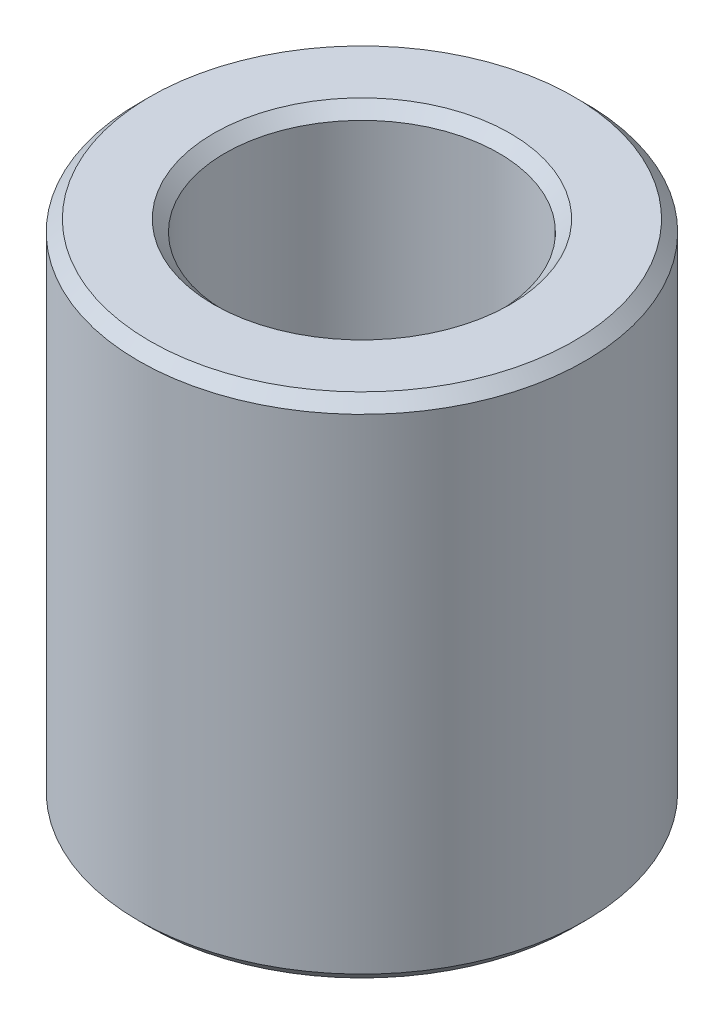
ISO-10303-21;
HEADER;
FILE_DESCRIPTION(('STEP AP214'),'2;1');
FILE_NAME('part.step','',(''),(''),'','','');
FILE_SCHEMA(('AUTOMOTIVE_DESIGN { 1 0 10303 214 1 1 1 1 }'));
ENDSEC;
DATA;
#1=APPLICATION_CONTEXT('core data for automotive mechanical design processes');
#2=APPLICATION_PROTOCOL_DEFINITION('international standard','automotive_design',2000,#1);
#3=PRODUCT_CONTEXT('',#1,'mechanical');
#4=PRODUCT('Part','Part','',(#3));
#5=PRODUCT_RELATED_PRODUCT_CATEGORY('part','',(#4));
#6=PRODUCT_DEFINITION_FORMATION('','',#4);
#7=PRODUCT_DEFINITION_CONTEXT('part definition',#1,'design');
#8=PRODUCT_DEFINITION('design','',#6,#7);
#9=PRODUCT_DEFINITION_SHAPE('','',#8);
#10=(LENGTH_UNIT() NAMED_UNIT(*) SI_UNIT(.MILLI.,.METRE.));
#11=(NAMED_UNIT(*) PLANE_ANGLE_UNIT() SI_UNIT($,.RADIAN.));
#12=(NAMED_UNIT(*) SI_UNIT($,.STERADIAN.) SOLID_ANGLE_UNIT());
#13=UNCERTAINTY_MEASURE_WITH_UNIT(LENGTH_MEASURE(1.E-05),#10,'distance_accuracy_value','');
#14=(GEOMETRIC_REPRESENTATION_CONTEXT(3) GLOBAL_UNCERTAINTY_ASSIGNED_CONTEXT((#13)) GLOBAL_UNIT_ASSIGNED_CONTEXT((#10,
#11,#12)) REPRESENTATION_CONTEXT('',''));
#15=CARTESIAN_POINT('',(0.,0.,0.));
#16=DIRECTION('',(0.,0.,1.));
#17=DIRECTION('',(1.,0.,0.));
#18=AXIS2_PLACEMENT_3D('',#15,#16,#17);
#19=CARTESIAN_POINT('',(0.,45.4693690637865,0.));
#20=DIRECTION('',(0.,-1.,0.));
#21=DIRECTION('',(0.,0.,-1.));
#22=AXIS2_PLACEMENT_3D('',#19,#20,#21);
#23=CYLINDRICAL_SURFACE('',#22,20.);
#24=CARTESIAN_POINT('',(0.,1.02240950876795,0.));
#25=DIRECTION('',(0.,1.,0.));
#26=DIRECTION('',(0.,0.,1.));
#27=AXIS2_PLACEMENT_3D('',#24,#25,#26);
#28=CIRCLE('',#27,20.);
#29=CARTESIAN_POINT('',(0.,1.02240950876795,20.));
#30=VERTEX_POINT('',#29);
#31=EDGE_CURVE('E10',#30,#30,#28,.T.);
#32=ORIENTED_EDGE('',*,*,#31,.T.);
#33=EDGE_LOOP('',(#32));
#34=FACE_BOUND('',#33,.T.);
#35=CARTESIAN_POINT('',(0.,44.4469595550186,0.));
#36=DIRECTION('',(0.,1.,0.));
#37=DIRECTION('',(0.,0.,1.));
#38=AXIS2_PLACEMENT_3D('',#35,#36,#37);
#39=CIRCLE('',#38,20.);
#40=CARTESIAN_POINT('',(0.,44.4469595550186,20.));
#41=VERTEX_POINT('',#40);
#42=EDGE_CURVE('E50',#41,#41,#39,.F.);
#43=ORIENTED_EDGE('',*,*,#42,.T.);
#44=EDGE_LOOP('',(#43));
#45=FACE_BOUND('',#44,.T.);
#46=ADVANCED_FACE('F39',(#34,#45),#23,.T.);
#47=CARTESIAN_POINT('',(0.,45.4693690637865,0.));
#48=DIRECTION('',(0.,1.,0.));
#49=DIRECTION('',(0.,0.,1.));
#50=AXIS2_PLACEMENT_3D('',#47,#48,#49);
#51=PLANE('',#50);
#52=CARTESIAN_POINT('',(0.,45.4693690637865,0.));
#53=DIRECTION('',(0.,1.,0.));
#54=DIRECTION('',(0.,0.,1.));
#55=AXIS2_PLACEMENT_3D('',#52,#53,#54);
#56=CIRCLE('',#55,13.2822934045507);
#57=CARTESIAN_POINT('',(0.,45.4693690637865,13.2822934045507));
#58=VERTEX_POINT('',#57);
#59=EDGE_CURVE('E58',#58,#58,#56,.F.);
#60=ORIENTED_EDGE('',*,*,#59,.T.);
#61=EDGE_LOOP('',(#60));
#62=FACE_BOUND('',#61,.T.);
#63=CARTESIAN_POINT('',(0.,45.4693690637865,0.));
#64=DIRECTION('',(0.,1.,0.));
#65=DIRECTION('',(0.,0.,1.));
#66=AXIS2_PLACEMENT_3D('',#63,#64,#65);
#67=CIRCLE('',#66,18.977590491232);
#68=CARTESIAN_POINT('',(0.,45.4693690637865,18.977590491232));
#69=VERTEX_POINT('',#68);
#70=EDGE_CURVE('E61',#69,#69,#67,.T.);
#71=ORIENTED_EDGE('',*,*,#70,.T.);
#72=EDGE_LOOP('',(#71));
#73=FACE_BOUND('',#72,.T.);
#74=ADVANCED_FACE('F88',(#62,#73),#51,.T.);
#75=CARTESIAN_POINT('',(0.,0.,0.));
#76=DIRECTION('',(0.,1.,0.));
#77=DIRECTION('',(0.,0.,1.));
#78=AXIS2_PLACEMENT_3D('',#75,#76,#77);
#79=PLANE('',#78);
#80=CARTESIAN_POINT('',(0.,0.,0.));
#81=DIRECTION('',(0.,1.,0.));
#82=DIRECTION('',(0.,0.,1.));
#83=AXIS2_PLACEMENT_3D('',#80,#81,#82);
#84=CIRCLE('',#83,13.2822934045507);
#85=CARTESIAN_POINT('',(0.,0.,13.2822934045507));
#86=VERTEX_POINT('',#85);
#87=EDGE_CURVE('E51',#86,#86,#84,.T.);
#88=ORIENTED_EDGE('',*,*,#87,.T.);
#89=EDGE_LOOP('',(#88));
#90=FACE_BOUND('',#89,.T.);
#91=CARTESIAN_POINT('',(0.,0.,0.));
#92=DIRECTION('',(0.,1.,0.));
#93=DIRECTION('',(0.,0.,1.));
#94=AXIS2_PLACEMENT_3D('',#91,#92,#93);
#95=CIRCLE('',#94,18.977590491232);
#96=CARTESIAN_POINT('',(0.,0.,18.977590491232));
#97=VERTEX_POINT('',#96);
#98=EDGE_CURVE('E54',#97,#97,#95,.F.);
#99=ORIENTED_EDGE('',*,*,#98,.T.);
#100=EDGE_LOOP('',(#99));
#101=FACE_BOUND('',#100,.T.);
#102=ADVANCED_FACE('F83',(#90,#101),#79,.F.);
#103=CARTESIAN_POINT('',(0.,45.4693690637865,0.));
#104=DIRECTION('',(0.,-1.,0.));
#105=DIRECTION('',(0.,0.,-1.));
#106=AXIS2_PLACEMENT_3D('',#103,#104,#105);
#107=CYLINDRICAL_SURFACE('',#106,12.2598838957827);
#108=CARTESIAN_POINT('',(0.,44.4469595550186,0.));
#109=DIRECTION('',(0.,1.,0.));
#110=DIRECTION('',(0.,0.,1.));
#111=AXIS2_PLACEMENT_3D('',#108,#109,#110);
#112=CIRCLE('',#111,12.2598838957827);
#113=CARTESIAN_POINT('',(0.,44.4469595550186,12.2598838957827));
#114=VERTEX_POINT('',#113);
#115=EDGE_CURVE('E67',#114,#114,#112,.T.);
#116=ORIENTED_EDGE('',*,*,#115,.T.);
#117=EDGE_LOOP('',(#116));
#118=FACE_BOUND('',#117,.T.);
#119=CARTESIAN_POINT('',(0.,1.02240950876796,0.));
#120=DIRECTION('',(0.,1.,0.));
#121=DIRECTION('',(0.,0.,1.));
#122=AXIS2_PLACEMENT_3D('',#119,#120,#121);
#123=CIRCLE('',#122,12.2598838957827);
#124=CARTESIAN_POINT('',(0.,1.02240950876796,12.2598838957827));
#125=VERTEX_POINT('',#124);
#126=EDGE_CURVE('E69',#125,#125,#123,.F.);
#127=ORIENTED_EDGE('',*,*,#126,.T.);
#128=EDGE_LOOP('',(#127));
#129=FACE_BOUND('',#128,.T.);
#130=ADVANCED_FACE('F71',(#118,#129),#107,.F.);
#131=CARTESIAN_POINT('',(0.,44.4469595550186,0.));
#132=DIRECTION('',(0.,1.,0.));
#133=DIRECTION('',(0.,0.,1.));
#134=AXIS2_PLACEMENT_3D('',#131,#132,#133);
#135=CONICAL_SURFACE('',#134,12.2598838957827,0.785398163397457);
#136=ORIENTED_EDGE('',*,*,#59,.F.);
#137=EDGE_LOOP('',(#136));
#138=FACE_BOUND('',#137,.T.);
#139=ORIENTED_EDGE('',*,*,#115,.F.);
#140=EDGE_LOOP('',(#139));
#141=FACE_BOUND('',#140,.T.);
#142=ADVANCED_FACE('F77',(#138,#141),#135,.F.);
#143=CARTESIAN_POINT('',(0.,0.,0.));
#144=DIRECTION('',(0.,-1.,0.));
#145=DIRECTION('',(0.,0.,-1.));
#146=AXIS2_PLACEMENT_3D('',#143,#144,#145);
#147=CONICAL_SURFACE('',#146,13.2822934045507,0.785398163397447);
#148=ORIENTED_EDGE('',*,*,#126,.F.);
#149=EDGE_LOOP('',(#148));
#150=FACE_BOUND('',#149,.T.);
#151=ORIENTED_EDGE('',*,*,#87,.F.);
#152=EDGE_LOOP('',(#151));
#153=FACE_BOUND('',#152,.T.);
#154=ADVANCED_FACE('F73',(#150,#153),#147,.F.);
#155=CARTESIAN_POINT('',(0.,1.02240950876795,0.));
#156=DIRECTION('',(0.,1.,0.));
#157=DIRECTION('',(0.,0.,1.));
#158=AXIS2_PLACEMENT_3D('',#155,#156,#157);
#159=CONICAL_SURFACE('',#158,20.,0.78539816339745);
#160=ORIENTED_EDGE('',*,*,#98,.F.);
#161=EDGE_LOOP('',(#160));
#162=FACE_BOUND('',#161,.T.);
#163=ORIENTED_EDGE('',*,*,#31,.F.);
#164=EDGE_LOOP('',(#163));
#165=FACE_BOUND('',#164,.T.);
#166=ADVANCED_FACE('F76',(#162,#165),#159,.T.);
#167=CARTESIAN_POINT('',(0.,45.4693690637865,0.));
#168=DIRECTION('',(0.,-1.,0.));
#169=DIRECTION('',(0.,0.,-1.));
#170=AXIS2_PLACEMENT_3D('',#167,#168,#169);
#171=CONICAL_SURFACE('',#170,18.977590491232,0.785398163397447);
#172=ORIENTED_EDGE('',*,*,#42,.F.);
#173=EDGE_LOOP('',(#172));
#174=FACE_BOUND('',#173,.T.);
#175=ORIENTED_EDGE('',*,*,#70,.F.);
#176=EDGE_LOOP('',(#175));
#177=FACE_BOUND('',#176,.T.);
#178=ADVANCED_FACE('F45',(#174,#177),#171,.T.);
#179=CLOSED_SHELL('',(#46,#74,#102,#130,#142,#154,#166,#178));
#180=MANIFOLD_SOLID_BREP('B2',#179);
#181=ADVANCED_BREP_SHAPE_REPRESENTATION('',(#18,#180),#14);
#182=SHAPE_DEFINITION_REPRESENTATION(#9,#181);
ENDSEC;
END-ISO-10303-21;
